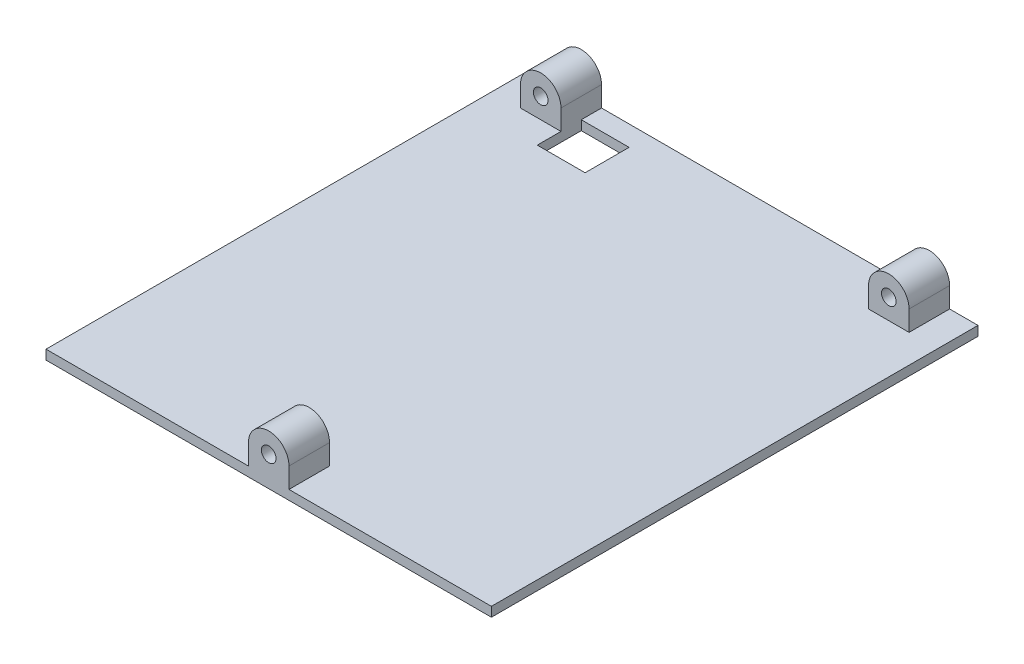
ISO-10303-21;
HEADER;
FILE_DESCRIPTION(('STEP AP214'),'2;1');
FILE_NAME('part.step','',(''),(''),'','','');
FILE_SCHEMA(('AUTOMOTIVE_DESIGN { 1 0 10303 214 1 1 1 1 }'));
ENDSEC;
DATA;
#1=APPLICATION_CONTEXT('core data for automotive mechanical design processes');
#2=APPLICATION_PROTOCOL_DEFINITION('international standard','automotive_design',2000,#1);
#3=PRODUCT_CONTEXT('',#1,'mechanical');
#4=PRODUCT('Part','Part','',(#3));
#5=PRODUCT_RELATED_PRODUCT_CATEGORY('part','',(#4));
#6=PRODUCT_DEFINITION_FORMATION('','',#4);
#7=PRODUCT_DEFINITION_CONTEXT('part definition',#1,'design');
#8=PRODUCT_DEFINITION('design','',#6,#7);
#9=PRODUCT_DEFINITION_SHAPE('','',#8);
#10=(LENGTH_UNIT() NAMED_UNIT(*) SI_UNIT(.MILLI.,.METRE.));
#11=(NAMED_UNIT(*) PLANE_ANGLE_UNIT() SI_UNIT($,.RADIAN.));
#12=(NAMED_UNIT(*) SI_UNIT($,.STERADIAN.) SOLID_ANGLE_UNIT());
#13=UNCERTAINTY_MEASURE_WITH_UNIT(LENGTH_MEASURE(1.E-05),#10,'distance_accuracy_value','');
#14=(GEOMETRIC_REPRESENTATION_CONTEXT(3) GLOBAL_UNCERTAINTY_ASSIGNED_CONTEXT((#13)) GLOBAL_UNIT_ASSIGNED_CONTEXT((#10,
#11,#12)) REPRESENTATION_CONTEXT('',''));
#15=CARTESIAN_POINT('',(0.,0.,0.));
#16=DIRECTION('',(0.,0.,1.));
#17=DIRECTION('',(1.,0.,0.));
#18=AXIS2_PLACEMENT_3D('',#15,#16,#17);
#19=CARTESIAN_POINT('',(0.,6.35,0.));
#20=DIRECTION('',(1.,0.,0.));
#21=DIRECTION('',(0.,0.,-1.));
#22=AXIS2_PLACEMENT_3D('',#19,#20,#21);
#23=PLANE('',#22);
#24=DIRECTION('',(0.,0.,1.));
#25=VECTOR('',#24,1.);
#26=CARTESIAN_POINT('',(0.,2.975,-152.4));
#27=LINE('',#26,#25);
#28=CARTESIAN_POINT('',(0.,2.975,-152.4));
#29=VERTEX_POINT('',#28);
#30=CARTESIAN_POINT('',(0.,2.975,0.));
#31=VERTEX_POINT('',#30);
#32=EDGE_CURVE('E361',#29,#31,#27,.T.);
#33=ORIENTED_EDGE('',*,*,#32,.F.);
#34=DIRECTION('',(0.,-1.,0.));
#35=VECTOR('',#34,1.);
#36=CARTESIAN_POINT('',(0.,6.35,-152.4));
#37=LINE('',#36,#35);
#38=CARTESIAN_POINT('',(0.,0.,-152.4));
#39=VERTEX_POINT('',#38);
#40=EDGE_CURVE('E402',#29,#39,#37,.T.);
#41=ORIENTED_EDGE('',*,*,#40,.T.);
#42=DIRECTION('',(0.,0.,1.));
#43=VECTOR('',#42,1.);
#44=CARTESIAN_POINT('',(0.,0.,0.));
#45=LINE('',#44,#43);
#46=CARTESIAN_POINT('',(0.,0.,0.));
#47=VERTEX_POINT('',#46);
#48=EDGE_CURVE('E385',#39,#47,#45,.T.);
#49=ORIENTED_EDGE('',*,*,#48,.T.);
#50=DIRECTION('',(0.,-1.,0.));
#51=VECTOR('',#50,1.);
#52=CARTESIAN_POINT('',(0.,6.35,0.));
#53=LINE('',#52,#51);
#54=EDGE_CURVE('E11',#31,#47,#53,.T.);
#55=ORIENTED_EDGE('',*,*,#54,.F.);
#56=EDGE_LOOP('',(#33,#41,#49,#55));
#57=FACE_BOUND('',#56,.T.);
#58=ADVANCED_FACE('F38',(#57),#23,.F.);
#59=CARTESIAN_POINT('',(0.,6.35,0.));
#60=DIRECTION('',(0.,0.,-1.));
#61=DIRECTION('',(-1.,0.,0.));
#62=AXIS2_PLACEMENT_3D('',#59,#60,#61);
#63=PLANE('',#62);
#64=DIRECTION('',(1.,0.,0.));
#65=VECTOR('',#64,1.);
#66=CARTESIAN_POINT('',(0.,2.975,0.));
#67=LINE('',#66,#65);
#68=CARTESIAN_POINT('',(63.4,2.975,0.));
#69=VERTEX_POINT('',#68);
#70=EDGE_CURVE('E374',#31,#69,#67,.T.);
#71=ORIENTED_EDGE('',*,*,#70,.F.);
#72=ORIENTED_EDGE('',*,*,#54,.T.);
#73=DIRECTION('',(1.,0.,0.));
#74=VECTOR('',#73,1.);
#75=CARTESIAN_POINT('',(0.,0.,0.));
#76=LINE('',#75,#74);
#77=CARTESIAN_POINT('',(139.5,0.,0.));
#78=VERTEX_POINT('',#77);
#79=EDGE_CURVE('E390',#47,#78,#76,.T.);
#80=ORIENTED_EDGE('',*,*,#79,.T.);
#81=DIRECTION('',(0.,-1.,0.));
#82=VECTOR('',#81,1.);
#83=CARTESIAN_POINT('',(139.5,6.35,0.));
#84=LINE('',#83,#82);
#85=CARTESIAN_POINT('',(139.5,2.975,0.));
#86=VERTEX_POINT('',#85);
#87=EDGE_CURVE('E46',#86,#78,#84,.T.);
#88=ORIENTED_EDGE('',*,*,#87,.F.);
#89=CARTESIAN_POINT('',(76.1,2.975,0.));
#90=VERTEX_POINT('',#89);
#91=EDGE_CURVE('E373',#90,#86,#67,.T.);
#92=ORIENTED_EDGE('',*,*,#91,.F.);
#93=DIRECTION('',(0.,1.,0.));
#94=VECTOR('',#93,1.);
#95=CARTESIAN_POINT('',(76.1,9.32500015835304,0.));
#96=LINE('',#95,#94);
#97=CARTESIAN_POINT('',(76.1,9.32500015835304,0.));
#98=VERTEX_POINT('',#97);
#99=EDGE_CURVE('E335',#90,#98,#96,.T.);
#100=ORIENTED_EDGE('',*,*,#99,.T.);
#101=CARTESIAN_POINT('',(69.75,9.32500015835304,0.));
#102=DIRECTION('',(0.,0.,1.));
#103=DIRECTION('',(1.,0.,0.));
#104=AXIS2_PLACEMENT_3D('',#101,#102,#103);
#105=CIRCLE('',#104,6.35);
#106=CARTESIAN_POINT('',(63.4,9.325,0.));
#107=VERTEX_POINT('',#106);
#108=EDGE_CURVE('E326',#98,#107,#105,.T.);
#109=ORIENTED_EDGE('',*,*,#108,.T.);
#110=DIRECTION('',(0.,-1.,0.));
#111=VECTOR('',#110,1.);
#112=CARTESIAN_POINT('',(63.4,9.325,0.));
#113=LINE('',#112,#111);
#114=EDGE_CURVE('E351',#107,#69,#113,.T.);
#115=ORIENTED_EDGE('',*,*,#114,.T.);
#116=EDGE_LOOP('',(#71,#72,#80,#88,#92,#100,#109,#115));
#117=FACE_BOUND('',#116,.T.);
#118=CARTESIAN_POINT('',(69.75,9.32500015835304,0.));
#119=DIRECTION('',(0.,0.,1.));
#120=DIRECTION('',(1.,0.,0.));
#121=AXIS2_PLACEMENT_3D('',#118,#119,#120);
#122=CIRCLE('',#121,2.28599999999999);
#123=CARTESIAN_POINT('',(72.036,9.32500015835304,0.));
#124=VERTEX_POINT('',#123);
#125=EDGE_CURVE('E311',#124,#124,#122,.T.);
#126=ORIENTED_EDGE('',*,*,#125,.F.);
#127=EDGE_LOOP('',(#126));
#128=FACE_BOUND('',#127,.T.);
#129=ADVANCED_FACE('F419',(#117,#128),#63,.F.);
#130=CARTESIAN_POINT('',(139.5,6.35,0.));
#131=DIRECTION('',(-1.,0.,0.));
#132=DIRECTION('',(0.,0.,1.));
#133=AXIS2_PLACEMENT_3D('',#130,#131,#132);
#134=PLANE('',#133);
#135=DIRECTION('',(0.,0.,-1.));
#136=VECTOR('',#135,1.);
#137=CARTESIAN_POINT('',(139.5,2.975,-152.4));
#138=LINE('',#137,#136);
#139=CARTESIAN_POINT('',(139.5,2.975,-152.4));
#140=VERTEX_POINT('',#139);
#141=EDGE_CURVE('E378',#86,#140,#138,.T.);
#142=ORIENTED_EDGE('',*,*,#141,.F.);
#143=ORIENTED_EDGE('',*,*,#87,.T.);
#144=DIRECTION('',(0.,0.,-1.));
#145=VECTOR('',#144,1.);
#146=CARTESIAN_POINT('',(139.5,0.,0.));
#147=LINE('',#146,#145);
#148=CARTESIAN_POINT('',(139.5,0.,-152.4));
#149=VERTEX_POINT('',#148);
#150=EDGE_CURVE('E394',#78,#149,#147,.T.);
#151=ORIENTED_EDGE('',*,*,#150,.T.);
#152=DIRECTION('',(0.,-1.,0.));
#153=VECTOR('',#152,1.);
#154=CARTESIAN_POINT('',(139.5,6.35,-152.4));
#155=LINE('',#154,#153);
#156=EDGE_CURVE('E405',#140,#149,#155,.T.);
#157=ORIENTED_EDGE('',*,*,#156,.F.);
#158=EDGE_LOOP('',(#142,#143,#151,#157));
#159=FACE_BOUND('',#158,.T.);
#160=ADVANCED_FACE('F411',(#159),#134,.F.);
#161=CARTESIAN_POINT('',(0.,6.35,-152.4));
#162=DIRECTION('',(0.,0.,1.));
#163=DIRECTION('',(1.,0.,0.));
#164=AXIS2_PLACEMENT_3D('',#161,#162,#163);
#165=PLANE('',#164);
#166=DIRECTION('',(-1.,0.,0.));
#167=VECTOR('',#166,1.);
#168=CARTESIAN_POINT('',(0.,2.975,-152.4));
#169=LINE('',#168,#167);
#170=CARTESIAN_POINT('',(130.61,2.975,-152.4));
#171=VERTEX_POINT('',#170);
#172=EDGE_CURVE('E382',#140,#171,#169,.T.);
#173=ORIENTED_EDGE('',*,*,#172,.F.);
#174=ORIENTED_EDGE('',*,*,#156,.T.);
#175=DIRECTION('',(-1.,0.,0.));
#176=VECTOR('',#175,1.);
#177=CARTESIAN_POINT('',(0.,0.,-152.4));
#178=LINE('',#177,#176);
#179=EDGE_CURVE('E398',#149,#39,#178,.T.);
#180=ORIENTED_EDGE('',*,*,#179,.T.);
#181=ORIENTED_EDGE('',*,*,#40,.F.);
#182=CARTESIAN_POINT('',(8.89,2.975,-152.4));
#183=VERTEX_POINT('',#182);
#184=EDGE_CURVE('E381',#183,#29,#169,.T.);
#185=ORIENTED_EDGE('',*,*,#184,.F.);
#186=DIRECTION('',(0.,1.,0.));
#187=VECTOR('',#186,1.);
#188=CARTESIAN_POINT('',(8.89,9.325,-152.4));
#189=LINE('',#188,#187);
#190=CARTESIAN_POINT('',(8.89,9.325,-152.4));
#191=VERTEX_POINT('',#190);
#192=EDGE_CURVE('E239',#183,#191,#189,.T.);
#193=ORIENTED_EDGE('',*,*,#192,.T.);
#194=CARTESIAN_POINT('',(15.24,9.325,-152.4));
#195=DIRECTION('',(0.,0.,-1.));
#196=DIRECTION('',(-1.,0.,0.));
#197=AXIS2_PLACEMENT_3D('',#194,#195,#196);
#198=CIRCLE('',#197,6.35);
#199=CARTESIAN_POINT('',(21.59,9.325,-152.4));
#200=VERTEX_POINT('',#199);
#201=EDGE_CURVE('E230',#191,#200,#198,.T.);
#202=ORIENTED_EDGE('',*,*,#201,.T.);
#203=DIRECTION('',(0.,-1.,0.));
#204=VECTOR('',#203,1.);
#205=CARTESIAN_POINT('',(21.59,9.325,-152.4));
#206=LINE('',#205,#204);
#207=CARTESIAN_POINT('',(21.59,2.975,-152.4));
#208=VERTEX_POINT('',#207);
#209=EDGE_CURVE('E253',#200,#208,#206,.T.);
#210=ORIENTED_EDGE('',*,*,#209,.T.);
#211=CARTESIAN_POINT('',(117.91,2.975,-152.4));
#212=VERTEX_POINT('',#211);
#213=EDGE_CURVE('E386',#212,#208,#169,.T.);
#214=ORIENTED_EDGE('',*,*,#213,.F.);
#215=DIRECTION('',(0.,1.,0.));
#216=VECTOR('',#215,1.);
#217=CARTESIAN_POINT('',(117.91,9.325,-152.4));
#218=LINE('',#217,#216);
#219=CARTESIAN_POINT('',(117.91,9.325,-152.4));
#220=VERTEX_POINT('',#219);
#221=EDGE_CURVE('E286',#212,#220,#218,.T.);
#222=ORIENTED_EDGE('',*,*,#221,.T.);
#223=CARTESIAN_POINT('',(124.26,9.325,-152.4));
#224=DIRECTION('',(0.,0.,-1.));
#225=DIRECTION('',(-1.,0.,0.));
#226=AXIS2_PLACEMENT_3D('',#223,#224,#225);
#227=CIRCLE('',#226,6.35);
#228=CARTESIAN_POINT('',(130.61,9.325,-152.4));
#229=VERTEX_POINT('',#228);
#230=EDGE_CURVE('E277',#220,#229,#227,.T.);
#231=ORIENTED_EDGE('',*,*,#230,.T.);
#232=DIRECTION('',(0.,-1.,0.));
#233=VECTOR('',#232,1.);
#234=CARTESIAN_POINT('',(130.61,9.325,-152.4));
#235=LINE('',#234,#233);
#236=EDGE_CURVE('E301',#229,#171,#235,.T.);
#237=ORIENTED_EDGE('',*,*,#236,.T.);
#238=EDGE_LOOP('',(#173,#174,#180,#181,#185,#193,#202,#210,#214,#222,#231,#237));
#239=FACE_BOUND('',#238,.T.);
#240=CARTESIAN_POINT('',(124.26,9.325,-152.4));
#241=DIRECTION('',(0.,0.,-1.));
#242=DIRECTION('',(-1.,0.,0.));
#243=AXIS2_PLACEMENT_3D('',#240,#241,#242);
#244=CIRCLE('',#243,2.28599999999999);
#245=CARTESIAN_POINT('',(121.974,9.325,-152.4));
#246=VERTEX_POINT('',#245);
#247=EDGE_CURVE('E263',#246,#246,#244,.T.);
#248=ORIENTED_EDGE('',*,*,#247,.F.);
#249=EDGE_LOOP('',(#248));
#250=FACE_BOUND('',#249,.T.);
#251=CARTESIAN_POINT('',(15.24,9.325,-152.4));
#252=DIRECTION('',(0.,0.,-1.));
#253=DIRECTION('',(-1.,0.,0.));
#254=AXIS2_PLACEMENT_3D('',#251,#252,#253);
#255=CIRCLE('',#254,2.286);
#256=CARTESIAN_POINT('',(12.954,9.325,-152.4));
#257=VERTEX_POINT('',#256);
#258=EDGE_CURVE('E220',#257,#257,#255,.T.);
#259=ORIENTED_EDGE('',*,*,#258,.F.);
#260=EDGE_LOOP('',(#259));
#261=FACE_BOUND('',#260,.T.);
#262=ADVANCED_FACE('F426',(#239,#250,#261),#165,.F.);
#263=CARTESIAN_POINT('',(0.,0.,0.));
#264=DIRECTION('',(0.,-1.,0.));
#265=DIRECTION('',(0.,0.,-1.));
#266=AXIS2_PLACEMENT_3D('',#263,#264,#265);
#267=PLANE('',#266);
#268=DIRECTION('',(0.,0.,1.));
#269=VECTOR('',#268,1.);
#270=CARTESIAN_POINT('',(21.59,0.,-146.05));
#271=LINE('',#270,#269);
#272=CARTESIAN_POINT('',(21.59,0.,-146.05));
#273=VERTEX_POINT('',#272);
#274=CARTESIAN_POINT('',(21.59,0.,-132.2705));
#275=VERTEX_POINT('',#274);
#276=EDGE_CURVE('E179',#273,#275,#271,.T.);
#277=ORIENTED_EDGE('',*,*,#276,.T.);
#278=DIRECTION('',(1.,0.,0.));
#279=VECTOR('',#278,1.);
#280=CARTESIAN_POINT('',(21.59,0.,-132.2705));
#281=LINE('',#280,#279);
#282=CARTESIAN_POINT('',(36.576,0.,-132.2705));
#283=VERTEX_POINT('',#282);
#284=EDGE_CURVE('E191',#275,#283,#281,.T.);
#285=ORIENTED_EDGE('',*,*,#284,.T.);
#286=DIRECTION('',(0.,0.,-1.));
#287=VECTOR('',#286,1.);
#288=CARTESIAN_POINT('',(36.576,0.,-146.05));
#289=LINE('',#288,#287);
#290=CARTESIAN_POINT('',(36.576,0.,-146.05));
#291=VERTEX_POINT('',#290);
#292=EDGE_CURVE('E53',#283,#291,#289,.T.);
#293=ORIENTED_EDGE('',*,*,#292,.T.);
#294=DIRECTION('',(-1.,0.,0.));
#295=VECTOR('',#294,1.);
#296=CARTESIAN_POINT('',(21.59,0.,-146.05));
#297=LINE('',#296,#295);
#298=EDGE_CURVE('E188',#291,#273,#297,.T.);
#299=ORIENTED_EDGE('',*,*,#298,.T.);
#300=EDGE_LOOP('',(#277,#285,#293,#299));
#301=FACE_BOUND('',#300,.T.);
#302=ORIENTED_EDGE('',*,*,#48,.F.);
#303=ORIENTED_EDGE('',*,*,#179,.F.);
#304=ORIENTED_EDGE('',*,*,#150,.F.);
#305=ORIENTED_EDGE('',*,*,#79,.F.);
#306=EDGE_LOOP('',(#302,#303,#304,#305));
#307=FACE_BOUND('',#306,.T.);
#308=ADVANCED_FACE('F196',(#301,#307),#267,.T.);
#309=CARTESIAN_POINT('',(0.,2.975,0.));
#310=DIRECTION('',(0.,1.,0.));
#311=DIRECTION('',(0.,0.,1.));
#312=AXIS2_PLACEMENT_3D('',#309,#310,#311);
#313=PLANE('',#312);
#314=DIRECTION('',(0.,0.,1.));
#315=VECTOR('',#314,1.);
#316=CARTESIAN_POINT('',(21.59,2.975,-146.05));
#317=LINE('',#316,#315);
#318=CARTESIAN_POINT('',(21.59,2.975,-139.7));
#319=VERTEX_POINT('',#318);
#320=CARTESIAN_POINT('',(21.59,2.975,-132.2705));
#321=VERTEX_POINT('',#320);
#322=EDGE_CURVE('E182',#319,#321,#317,.T.);
#323=ORIENTED_EDGE('',*,*,#322,.F.);
#324=DIRECTION('',(-1.,0.,0.));
#325=VECTOR('',#324,1.);
#326=CARTESIAN_POINT('',(21.59,2.975,-139.7));
#327=LINE('',#326,#325);
#328=CARTESIAN_POINT('',(8.89,2.975,-139.7));
#329=VERTEX_POINT('',#328);
#330=EDGE_CURVE('E242',#319,#329,#327,.T.);
#331=ORIENTED_EDGE('',*,*,#330,.T.);
#332=DIRECTION('',(0.,0.,-1.));
#333=VECTOR('',#332,1.);
#334=CARTESIAN_POINT('',(8.89,2.975,-139.7));
#335=LINE('',#334,#333);
#336=EDGE_CURVE('E264',#329,#183,#335,.T.);
#337=ORIENTED_EDGE('',*,*,#336,.T.);
#338=ORIENTED_EDGE('',*,*,#184,.T.);
#339=ORIENTED_EDGE('',*,*,#32,.T.);
#340=ORIENTED_EDGE('',*,*,#70,.T.);
#341=DIRECTION('',(0.,0.,1.));
#342=VECTOR('',#341,1.);
#343=CARTESIAN_POINT('',(63.4,2.975,-12.7));
#344=LINE('',#343,#342);
#345=CARTESIAN_POINT('',(63.4,2.975,-12.7));
#346=VERTEX_POINT('',#345);
#347=EDGE_CURVE('E366',#346,#69,#344,.T.);
#348=ORIENTED_EDGE('',*,*,#347,.F.);
#349=DIRECTION('',(1.,0.,0.));
#350=VECTOR('',#349,1.);
#351=CARTESIAN_POINT('',(63.4,2.975,-12.7));
#352=LINE('',#351,#350);
#353=CARTESIAN_POINT('',(76.1,2.97500000000001,-12.7));
#354=VERTEX_POINT('',#353);
#355=EDGE_CURVE('E339',#346,#354,#352,.T.);
#356=ORIENTED_EDGE('',*,*,#355,.T.);
#357=DIRECTION('',(0.,0.,1.));
#358=VECTOR('',#357,1.);
#359=CARTESIAN_POINT('',(76.1,2.97500000000001,-12.7));
#360=LINE('',#359,#358);
#361=EDGE_CURVE('E362',#354,#90,#360,.T.);
#362=ORIENTED_EDGE('',*,*,#361,.T.);
#363=ORIENTED_EDGE('',*,*,#91,.T.);
#364=ORIENTED_EDGE('',*,*,#141,.T.);
#365=ORIENTED_EDGE('',*,*,#172,.T.);
#366=DIRECTION('',(0.,0.,-1.));
#367=VECTOR('',#366,1.);
#368=CARTESIAN_POINT('',(130.61,2.975,-139.7));
#369=LINE('',#368,#367);
#370=CARTESIAN_POINT('',(130.61,2.975,-139.7));
#371=VERTEX_POINT('',#370);
#372=EDGE_CURVE('E316',#371,#171,#369,.T.);
#373=ORIENTED_EDGE('',*,*,#372,.F.);
#374=DIRECTION('',(-1.,0.,0.));
#375=VECTOR('',#374,1.);
#376=CARTESIAN_POINT('',(130.61,2.975,-139.7));
#377=LINE('',#376,#375);
#378=CARTESIAN_POINT('',(117.91,2.975,-139.7));
#379=VERTEX_POINT('',#378);
#380=EDGE_CURVE('E290',#371,#379,#377,.T.);
#381=ORIENTED_EDGE('',*,*,#380,.T.);
#382=DIRECTION('',(0.,0.,-1.));
#383=VECTOR('',#382,1.);
#384=CARTESIAN_POINT('',(117.91,2.975,-139.7));
#385=LINE('',#384,#383);
#386=EDGE_CURVE('E312',#379,#212,#385,.T.);
#387=ORIENTED_EDGE('',*,*,#386,.T.);
#388=ORIENTED_EDGE('',*,*,#213,.T.);
#389=DIRECTION('',(0.,0.,-1.));
#390=VECTOR('',#389,1.);
#391=CARTESIAN_POINT('',(21.59,2.975,-139.7));
#392=LINE('',#391,#390);
#393=CARTESIAN_POINT('',(21.59,2.975,-146.05));
#394=VERTEX_POINT('',#393);
#395=EDGE_CURVE('E268',#394,#208,#392,.T.);
#396=ORIENTED_EDGE('',*,*,#395,.F.);
#397=DIRECTION('',(-1.,0.,0.));
#398=VECTOR('',#397,1.);
#399=CARTESIAN_POINT('',(21.59,2.975,-146.05));
#400=LINE('',#399,#398);
#401=CARTESIAN_POINT('',(36.576,2.975,-146.05));
#402=VERTEX_POINT('',#401);
#403=EDGE_CURVE('E61',#402,#394,#400,.T.);
#404=ORIENTED_EDGE('',*,*,#403,.F.);
#405=DIRECTION('',(0.,0.,-1.));
#406=VECTOR('',#405,1.);
#407=CARTESIAN_POINT('',(36.576,2.975,-146.05));
#408=LINE('',#407,#406);
#409=CARTESIAN_POINT('',(36.576,2.975,-132.2705));
#410=VERTEX_POINT('',#409);
#411=EDGE_CURVE('E202',#410,#402,#408,.T.);
#412=ORIENTED_EDGE('',*,*,#411,.F.);
#413=DIRECTION('',(1.,0.,0.));
#414=VECTOR('',#413,1.);
#415=CARTESIAN_POINT('',(21.59,2.975,-132.2705));
#416=LINE('',#415,#414);
#417=EDGE_CURVE('E211',#321,#410,#416,.T.);
#418=ORIENTED_EDGE('',*,*,#417,.F.);
#419=EDGE_LOOP('',(#323,#331,#337,#338,#339,#340,#348,#356,#362,#363,#364,#365,#373,#381,#387,
#388,#396,#404,#412,#418));
#420=FACE_BOUND('',#419,.T.);
#421=ADVANCED_FACE('F430',(#420),#313,.T.);
#422=CARTESIAN_POINT('',(69.75,9.32500015835304,-12.7));
#423=DIRECTION('',(0.,0.,1.));
#424=DIRECTION('',(1.,0.,0.));
#425=AXIS2_PLACEMENT_3D('',#422,#423,#424);
#426=CYLINDRICAL_SURFACE('',#425,6.35);
#427=ORIENTED_EDGE('',*,*,#108,.F.);
#428=DIRECTION('',(0.,0.,1.));
#429=VECTOR('',#428,1.);
#430=CARTESIAN_POINT('',(76.1,9.32500015835304,-12.7));
#431=LINE('',#430,#429);
#432=CARTESIAN_POINT('',(76.1,9.32500015835304,-12.7));
#433=VERTEX_POINT('',#432);
#434=EDGE_CURVE('E358',#433,#98,#431,.T.);
#435=ORIENTED_EDGE('',*,*,#434,.F.);
#436=CARTESIAN_POINT('',(69.75,9.32500015835304,-12.7));
#437=DIRECTION('',(0.,0.,1.));
#438=DIRECTION('',(1.,0.,0.));
#439=AXIS2_PLACEMENT_3D('',#436,#437,#438);
#440=CIRCLE('',#439,6.35);
#441=CARTESIAN_POINT('',(63.4,9.325,-12.7));
#442=VERTEX_POINT('',#441);
#443=EDGE_CURVE('E330',#433,#442,#440,.T.);
#444=ORIENTED_EDGE('',*,*,#443,.T.);
#445=DIRECTION('',(0.,0.,1.));
#446=VECTOR('',#445,1.);
#447=CARTESIAN_POINT('',(63.4,9.325,-12.7));
#448=LINE('',#447,#446);
#449=EDGE_CURVE('E347',#442,#107,#448,.T.);
#450=ORIENTED_EDGE('',*,*,#449,.T.);
#451=EDGE_LOOP('',(#427,#435,#444,#450));
#452=FACE_BOUND('',#451,.T.);
#453=ADVANCED_FACE('F481',(#452),#426,.T.);
#454=CARTESIAN_POINT('',(76.1,9.32500015835304,-12.7));
#455=DIRECTION('',(1.,0.,0.));
#456=DIRECTION('',(0.,0.,-1.));
#457=AXIS2_PLACEMENT_3D('',#454,#455,#456);
#458=PLANE('',#457);
#459=ORIENTED_EDGE('',*,*,#99,.F.);
#460=ORIENTED_EDGE('',*,*,#361,.F.);
#461=DIRECTION('',(0.,1.,0.));
#462=VECTOR('',#461,1.);
#463=CARTESIAN_POINT('',(76.1,9.32500015835304,-12.7));
#464=LINE('',#463,#462);
#465=EDGE_CURVE('E343',#354,#433,#464,.T.);
#466=ORIENTED_EDGE('',*,*,#465,.T.);
#467=ORIENTED_EDGE('',*,*,#434,.T.);
#468=EDGE_LOOP('',(#459,#460,#466,#467));
#469=FACE_BOUND('',#468,.T.);
#470=ADVANCED_FACE('F484',(#469),#458,.T.);
#471=CARTESIAN_POINT('',(63.4,9.325,-12.7));
#472=DIRECTION('',(-1.,0.,0.));
#473=DIRECTION('',(0.,0.,1.));
#474=AXIS2_PLACEMENT_3D('',#471,#472,#473);
#475=PLANE('',#474);
#476=ORIENTED_EDGE('',*,*,#114,.F.);
#477=ORIENTED_EDGE('',*,*,#449,.F.);
#478=DIRECTION('',(0.,-1.,0.));
#479=VECTOR('',#478,1.);
#480=CARTESIAN_POINT('',(63.4,9.325,-12.7));
#481=LINE('',#480,#479);
#482=EDGE_CURVE('E334',#442,#346,#481,.T.);
#483=ORIENTED_EDGE('',*,*,#482,.T.);
#484=ORIENTED_EDGE('',*,*,#347,.T.);
#485=EDGE_LOOP('',(#476,#477,#483,#484));
#486=FACE_BOUND('',#485,.T.);
#487=ADVANCED_FACE('F486',(#486),#475,.T.);
#488=CARTESIAN_POINT('',(69.75,9.32500015835304,-12.7));
#489=DIRECTION('',(0.,0.,1.));
#490=DIRECTION('',(1.,0.,0.));
#491=AXIS2_PLACEMENT_3D('',#488,#489,#490);
#492=PLANE('',#491);
#493=CARTESIAN_POINT('',(69.75,9.32500015835304,-12.7));
#494=DIRECTION('',(0.,0.,1.));
#495=DIRECTION('',(1.,0.,0.));
#496=AXIS2_PLACEMENT_3D('',#493,#494,#495);
#497=CIRCLE('',#496,2.28599999999999);
#498=CARTESIAN_POINT('',(72.036,9.32500015835304,-12.7));
#499=VERTEX_POINT('',#498);
#500=EDGE_CURVE('E322',#499,#499,#497,.T.);
#501=ORIENTED_EDGE('',*,*,#500,.T.);
#502=EDGE_LOOP('',(#501));
#503=FACE_BOUND('',#502,.T.);
#504=ORIENTED_EDGE('',*,*,#443,.F.);
#505=ORIENTED_EDGE('',*,*,#465,.F.);
#506=ORIENTED_EDGE('',*,*,#355,.F.);
#507=ORIENTED_EDGE('',*,*,#482,.F.);
#508=EDGE_LOOP('',(#504,#505,#506,#507));
#509=FACE_BOUND('',#508,.T.);
#510=ADVANCED_FACE('F489',(#503,#509),#492,.F.);
#511=CARTESIAN_POINT('',(69.75,9.32500015835304,-12.7));
#512=DIRECTION('',(0.,0.,1.));
#513=DIRECTION('',(1.,0.,0.));
#514=AXIS2_PLACEMENT_3D('',#511,#512,#513);
#515=CYLINDRICAL_SURFACE('',#514,2.28599999999999);
#516=ORIENTED_EDGE('',*,*,#500,.F.);
#517=EDGE_LOOP('',(#516));
#518=FACE_BOUND('',#517,.T.);
#519=ORIENTED_EDGE('',*,*,#125,.T.);
#520=EDGE_LOOP('',(#519));
#521=FACE_BOUND('',#520,.T.);
#522=ADVANCED_FACE('F496',(#518,#521),#515,.F.);
#523=CARTESIAN_POINT('',(124.26,9.325,-139.7));
#524=DIRECTION('',(0.,0.,-1.));
#525=DIRECTION('',(-1.,0.,0.));
#526=AXIS2_PLACEMENT_3D('',#523,#524,#525);
#527=CYLINDRICAL_SURFACE('',#526,6.35);
#528=ORIENTED_EDGE('',*,*,#230,.F.);
#529=DIRECTION('',(0.,0.,-1.));
#530=VECTOR('',#529,1.);
#531=CARTESIAN_POINT('',(117.91,9.325,-139.7));
#532=LINE('',#531,#530);
#533=CARTESIAN_POINT('',(117.91,9.325,-139.7));
#534=VERTEX_POINT('',#533);
#535=EDGE_CURVE('E308',#534,#220,#532,.T.);
#536=ORIENTED_EDGE('',*,*,#535,.F.);
#537=CARTESIAN_POINT('',(124.26,9.325,-139.7));
#538=DIRECTION('',(0.,0.,-1.));
#539=DIRECTION('',(-1.,0.,0.));
#540=AXIS2_PLACEMENT_3D('',#537,#538,#539);
#541=CIRCLE('',#540,6.35);
#542=CARTESIAN_POINT('',(130.61,9.325,-139.7));
#543=VERTEX_POINT('',#542);
#544=EDGE_CURVE('E281',#534,#543,#541,.T.);
#545=ORIENTED_EDGE('',*,*,#544,.T.);
#546=DIRECTION('',(0.,0.,-1.));
#547=VECTOR('',#546,1.);
#548=CARTESIAN_POINT('',(130.61,9.325,-139.7));
#549=LINE('',#548,#547);
#550=EDGE_CURVE('E297',#543,#229,#549,.T.);
#551=ORIENTED_EDGE('',*,*,#550,.T.);
#552=EDGE_LOOP('',(#528,#536,#545,#551));
#553=FACE_BOUND('',#552,.T.);
#554=ADVANCED_FACE('F441',(#553),#527,.T.);
#555=CARTESIAN_POINT('',(117.91,9.325,-139.7));
#556=DIRECTION('',(-1.,0.,0.));
#557=DIRECTION('',(0.,0.,1.));
#558=AXIS2_PLACEMENT_3D('',#555,#556,#557);
#559=PLANE('',#558);
#560=ORIENTED_EDGE('',*,*,#221,.F.);
#561=ORIENTED_EDGE('',*,*,#386,.F.);
#562=DIRECTION('',(0.,1.,0.));
#563=VECTOR('',#562,1.);
#564=CARTESIAN_POINT('',(117.91,9.325,-139.7));
#565=LINE('',#564,#563);
#566=EDGE_CURVE('E293',#379,#534,#565,.T.);
#567=ORIENTED_EDGE('',*,*,#566,.T.);
#568=ORIENTED_EDGE('',*,*,#535,.T.);
#569=EDGE_LOOP('',(#560,#561,#567,#568));
#570=FACE_BOUND('',#569,.T.);
#571=ADVANCED_FACE('F444',(#570),#559,.T.);
#572=CARTESIAN_POINT('',(130.61,9.325,-139.7));
#573=DIRECTION('',(1.,0.,0.));
#574=DIRECTION('',(0.,0.,-1.));
#575=AXIS2_PLACEMENT_3D('',#572,#573,#574);
#576=PLANE('',#575);
#577=ORIENTED_EDGE('',*,*,#236,.F.);
#578=ORIENTED_EDGE('',*,*,#550,.F.);
#579=DIRECTION('',(0.,-1.,0.));
#580=VECTOR('',#579,1.);
#581=CARTESIAN_POINT('',(130.61,9.325,-139.7));
#582=LINE('',#581,#580);
#583=EDGE_CURVE('E285',#543,#371,#582,.T.);
#584=ORIENTED_EDGE('',*,*,#583,.T.);
#585=ORIENTED_EDGE('',*,*,#372,.T.);
#586=EDGE_LOOP('',(#577,#578,#584,#585));
#587=FACE_BOUND('',#586,.T.);
#588=ADVANCED_FACE('F433',(#587),#576,.T.);
#589=CARTESIAN_POINT('',(124.26,9.325,-139.7));
#590=DIRECTION('',(0.,0.,-1.));
#591=DIRECTION('',(-1.,0.,0.));
#592=AXIS2_PLACEMENT_3D('',#589,#590,#591);
#593=PLANE('',#592);
#594=CARTESIAN_POINT('',(124.26,9.325,-139.7));
#595=DIRECTION('',(0.,0.,-1.));
#596=DIRECTION('',(-1.,0.,0.));
#597=AXIS2_PLACEMENT_3D('',#594,#595,#596);
#598=CIRCLE('',#597,2.28599999999999);
#599=CARTESIAN_POINT('',(121.974,9.325,-139.7));
#600=VERTEX_POINT('',#599);
#601=EDGE_CURVE('E273',#600,#600,#598,.T.);
#602=ORIENTED_EDGE('',*,*,#601,.T.);
#603=EDGE_LOOP('',(#602));
#604=FACE_BOUND('',#603,.T.);
#605=ORIENTED_EDGE('',*,*,#544,.F.);
#606=ORIENTED_EDGE('',*,*,#566,.F.);
#607=ORIENTED_EDGE('',*,*,#380,.F.);
#608=ORIENTED_EDGE('',*,*,#583,.F.);
#609=EDGE_LOOP('',(#605,#606,#607,#608));
#610=FACE_BOUND('',#609,.T.);
#611=ADVANCED_FACE('F437',(#604,#610),#593,.F.);
#612=CARTESIAN_POINT('',(124.26,9.325,-139.7));
#613=DIRECTION('',(0.,0.,-1.));
#614=DIRECTION('',(-1.,0.,0.));
#615=AXIS2_PLACEMENT_3D('',#612,#613,#614);
#616=CYLINDRICAL_SURFACE('',#615,2.28599999999999);
#617=ORIENTED_EDGE('',*,*,#601,.F.);
#618=EDGE_LOOP('',(#617));
#619=FACE_BOUND('',#618,.T.);
#620=ORIENTED_EDGE('',*,*,#247,.T.);
#621=EDGE_LOOP('',(#620));
#622=FACE_BOUND('',#621,.T.);
#623=ADVANCED_FACE('F509',(#619,#622),#616,.F.);
#624=CARTESIAN_POINT('',(15.24,9.325,-139.7));
#625=DIRECTION('',(0.,0.,-1.));
#626=DIRECTION('',(-1.,0.,0.));
#627=AXIS2_PLACEMENT_3D('',#624,#625,#626);
#628=CYLINDRICAL_SURFACE('',#627,6.35);
#629=ORIENTED_EDGE('',*,*,#201,.F.);
#630=DIRECTION('',(0.,0.,-1.));
#631=VECTOR('',#630,1.);
#632=CARTESIAN_POINT('',(8.89,9.325,-139.7));
#633=LINE('',#632,#631);
#634=CARTESIAN_POINT('',(8.89,9.325,-139.7));
#635=VERTEX_POINT('',#634);
#636=EDGE_CURVE('E260',#635,#191,#633,.T.);
#637=ORIENTED_EDGE('',*,*,#636,.F.);
#638=CARTESIAN_POINT('',(15.24,9.325,-139.7));
#639=DIRECTION('',(0.,0.,-1.));
#640=DIRECTION('',(-1.,0.,0.));
#641=AXIS2_PLACEMENT_3D('',#638,#639,#640);
#642=CIRCLE('',#641,6.35);
#643=CARTESIAN_POINT('',(21.59,9.325,-139.7));
#644=VERTEX_POINT('',#643);
#645=EDGE_CURVE('E234',#635,#644,#642,.T.);
#646=ORIENTED_EDGE('',*,*,#645,.T.);
#647=DIRECTION('',(0.,0.,-1.));
#648=VECTOR('',#647,1.);
#649=CARTESIAN_POINT('',(21.59,9.325,-139.7));
#650=LINE('',#649,#648);
#651=EDGE_CURVE('E249',#644,#200,#650,.T.);
#652=ORIENTED_EDGE('',*,*,#651,.T.);
#653=EDGE_LOOP('',(#629,#637,#646,#652));
#654=FACE_BOUND('',#653,.T.);
#655=ADVANCED_FACE('F513',(#654),#628,.T.);
#656=CARTESIAN_POINT('',(8.89,9.325,-139.7));
#657=DIRECTION('',(-1.,0.,0.));
#658=DIRECTION('',(0.,-1.,0.));
#659=AXIS2_PLACEMENT_3D('',#656,#657,#658);
#660=PLANE('',#659);
#661=ORIENTED_EDGE('',*,*,#192,.F.);
#662=ORIENTED_EDGE('',*,*,#336,.F.);
#663=DIRECTION('',(0.,1.,0.));
#664=VECTOR('',#663,1.);
#665=CARTESIAN_POINT('',(8.89,9.325,-139.7));
#666=LINE('',#665,#664);
#667=EDGE_CURVE('E245',#329,#635,#666,.T.);
#668=ORIENTED_EDGE('',*,*,#667,.T.);
#669=ORIENTED_EDGE('',*,*,#636,.T.);
#670=EDGE_LOOP('',(#661,#662,#668,#669));
#671=FACE_BOUND('',#670,.T.);
#672=ADVANCED_FACE('F462',(#671),#660,.T.);
#673=CARTESIAN_POINT('',(21.59,9.325,-139.7));
#674=DIRECTION('',(1.,0.,0.));
#675=DIRECTION('',(0.,1.,0.));
#676=AXIS2_PLACEMENT_3D('',#673,#674,#675);
#677=PLANE('',#676);
#678=ORIENTED_EDGE('',*,*,#209,.F.);
#679=ORIENTED_EDGE('',*,*,#651,.F.);
#680=DIRECTION('',(0.,-1.,0.));
#681=VECTOR('',#680,1.);
#682=CARTESIAN_POINT('',(21.59,9.325,-139.7));
#683=LINE('',#682,#681);
#684=EDGE_CURVE('E238',#644,#319,#683,.T.);
#685=ORIENTED_EDGE('',*,*,#684,.T.);
#686=ORIENTED_EDGE('',*,*,#322,.T.);
#687=DIRECTION('',(0.,1.,0.));
#688=VECTOR('',#687,1.);
#689=CARTESIAN_POINT('',(21.59,0.,-132.2705));
#690=LINE('',#689,#688);
#691=EDGE_CURVE('E174',#275,#321,#690,.T.);
#692=ORIENTED_EDGE('',*,*,#691,.F.);
#693=ORIENTED_EDGE('',*,*,#276,.F.);
#694=DIRECTION('',(0.,1.,0.));
#695=VECTOR('',#694,1.);
#696=CARTESIAN_POINT('',(21.59,0.,-146.05));
#697=LINE('',#696,#695);
#698=EDGE_CURVE('E217',#273,#394,#697,.T.);
#699=ORIENTED_EDGE('',*,*,#698,.T.);
#700=ORIENTED_EDGE('',*,*,#395,.T.);
#701=EDGE_LOOP('',(#678,#679,#685,#686,#692,#693,#699,#700));
#702=FACE_BOUND('',#701,.T.);
#703=ADVANCED_FACE('F177',(#702),#677,.T.);
#704=CARTESIAN_POINT('',(15.24,9.325,-139.7));
#705=DIRECTION('',(0.,0.,-1.));
#706=DIRECTION('',(-1.,0.,0.));
#707=AXIS2_PLACEMENT_3D('',#704,#705,#706);
#708=PLANE('',#707);
#709=CARTESIAN_POINT('',(15.24,9.325,-139.7));
#710=DIRECTION('',(0.,0.,-1.));
#711=DIRECTION('',(-1.,0.,0.));
#712=AXIS2_PLACEMENT_3D('',#709,#710,#711);
#713=CIRCLE('',#712,2.286);
#714=CARTESIAN_POINT('',(12.954,9.325,-139.7));
#715=VERTEX_POINT('',#714);
#716=EDGE_CURVE('E226',#715,#715,#713,.T.);
#717=ORIENTED_EDGE('',*,*,#716,.T.);
#718=EDGE_LOOP('',(#717));
#719=FACE_BOUND('',#718,.T.);
#720=ORIENTED_EDGE('',*,*,#645,.F.);
#721=ORIENTED_EDGE('',*,*,#667,.F.);
#722=ORIENTED_EDGE('',*,*,#330,.F.);
#723=ORIENTED_EDGE('',*,*,#684,.F.);
#724=EDGE_LOOP('',(#720,#721,#722,#723));
#725=FACE_BOUND('',#724,.T.);
#726=ADVANCED_FACE('F459',(#719,#725),#708,.F.);
#727=CARTESIAN_POINT('',(15.24,9.325,-139.7));
#728=DIRECTION('',(0.,0.,-1.));
#729=DIRECTION('',(-1.,0.,0.));
#730=AXIS2_PLACEMENT_3D('',#727,#728,#729);
#731=CYLINDRICAL_SURFACE('',#730,2.286);
#732=ORIENTED_EDGE('',*,*,#716,.F.);
#733=EDGE_LOOP('',(#732));
#734=FACE_BOUND('',#733,.T.);
#735=ORIENTED_EDGE('',*,*,#258,.T.);
#736=EDGE_LOOP('',(#735));
#737=FACE_BOUND('',#736,.T.);
#738=ADVANCED_FACE('F524',(#734,#737),#731,.F.);
#739=CARTESIAN_POINT('',(21.59,0.,-146.05));
#740=DIRECTION('',(0.,0.,-1.));
#741=DIRECTION('',(-1.,0.,0.));
#742=AXIS2_PLACEMENT_3D('',#739,#740,#741);
#743=PLANE('',#742);
#744=ORIENTED_EDGE('',*,*,#403,.T.);
#745=ORIENTED_EDGE('',*,*,#698,.F.);
#746=ORIENTED_EDGE('',*,*,#298,.F.);
#747=DIRECTION('',(0.,1.,0.));
#748=VECTOR('',#747,1.);
#749=CARTESIAN_POINT('',(36.576,0.,-146.05));
#750=LINE('',#749,#748);
#751=EDGE_CURVE('E221',#291,#402,#750,.T.);
#752=ORIENTED_EDGE('',*,*,#751,.T.);
#753=EDGE_LOOP('',(#744,#745,#746,#752));
#754=FACE_BOUND('',#753,.T.);
#755=ADVANCED_FACE('F451',(#754),#743,.F.);
#756=CARTESIAN_POINT('',(36.576,0.,-146.05));
#757=DIRECTION('',(1.,0.,0.));
#758=DIRECTION('',(0.,0.,-1.));
#759=AXIS2_PLACEMENT_3D('',#756,#757,#758);
#760=PLANE('',#759);
#761=ORIENTED_EDGE('',*,*,#411,.T.);
#762=ORIENTED_EDGE('',*,*,#751,.F.);
#763=ORIENTED_EDGE('',*,*,#292,.F.);
#764=DIRECTION('',(0.,1.,0.));
#765=VECTOR('',#764,1.);
#766=CARTESIAN_POINT('',(36.576,0.,-132.2705));
#767=LINE('',#766,#765);
#768=EDGE_CURVE('E187',#283,#410,#767,.T.);
#769=ORIENTED_EDGE('',*,*,#768,.T.);
#770=EDGE_LOOP('',(#761,#762,#763,#769));
#771=FACE_BOUND('',#770,.T.);
#772=ADVANCED_FACE('F453',(#771),#760,.F.);
#773=CARTESIAN_POINT('',(21.59,0.,-132.2705));
#774=DIRECTION('',(0.,0.,1.));
#775=DIRECTION('',(1.,0.,0.));
#776=AXIS2_PLACEMENT_3D('',#773,#774,#775);
#777=PLANE('',#776);
#778=ORIENTED_EDGE('',*,*,#417,.T.);
#779=ORIENTED_EDGE('',*,*,#768,.F.);
#780=ORIENTED_EDGE('',*,*,#284,.F.);
#781=ORIENTED_EDGE('',*,*,#691,.T.);
#782=EDGE_LOOP('',(#778,#779,#780,#781));
#783=FACE_BOUND('',#782,.T.);
#784=ADVANCED_FACE('F192',(#783),#777,.F.);
#785=CLOSED_SHELL('',(#58,#129,#160,#262,#308,#421,#453,#470,#487,#510,#522,#554,#571,#588,#611,
#623,#655,#672,#703,#726,#738,#755,#772,#784));
#786=MANIFOLD_SOLID_BREP('B2',#785);
#787=ADVANCED_BREP_SHAPE_REPRESENTATION('',(#18,#786),#14);
#788=SHAPE_DEFINITION_REPRESENTATION(#9,#787);
ENDSEC;
END-ISO-10303-21;
